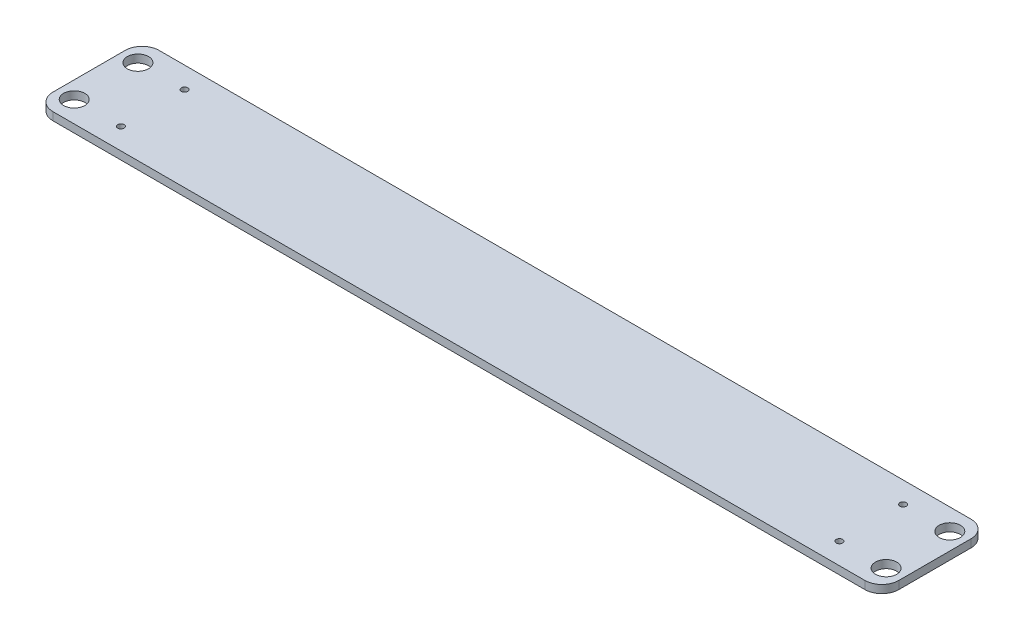
ISO-10303-21;
HEADER;
FILE_DESCRIPTION(('STEP AP214'),'2;1');
FILE_NAME('part.step','',(''),(''),'','','');
FILE_SCHEMA(('AUTOMOTIVE_DESIGN { 1 0 10303 214 1 1 1 1 }'));
ENDSEC;
DATA;
#1=APPLICATION_CONTEXT('core data for automotive mechanical design processes');
#2=APPLICATION_PROTOCOL_DEFINITION('international standard','automotive_design',2000,#1);
#3=PRODUCT_CONTEXT('',#1,'mechanical');
#4=PRODUCT('Part','Part','',(#3));
#5=PRODUCT_RELATED_PRODUCT_CATEGORY('part','',(#4));
#6=PRODUCT_DEFINITION_FORMATION('','',#4);
#7=PRODUCT_DEFINITION_CONTEXT('part definition',#1,'design');
#8=PRODUCT_DEFINITION('design','',#6,#7);
#9=PRODUCT_DEFINITION_SHAPE('','',#8);
#10=(LENGTH_UNIT() NAMED_UNIT(*) SI_UNIT(.MILLI.,.METRE.));
#11=(NAMED_UNIT(*) PLANE_ANGLE_UNIT() SI_UNIT($,.RADIAN.));
#12=(NAMED_UNIT(*) SI_UNIT($,.STERADIAN.) SOLID_ANGLE_UNIT());
#13=UNCERTAINTY_MEASURE_WITH_UNIT(LENGTH_MEASURE(1.E-05),#10,'distance_accuracy_value','');
#14=(GEOMETRIC_REPRESENTATION_CONTEXT(3) GLOBAL_UNCERTAINTY_ASSIGNED_CONTEXT((#13)) GLOBAL_UNIT_ASSIGNED_CONTEXT((#10,
#11,#12)) REPRESENTATION_CONTEXT('',''));
#15=CARTESIAN_POINT('',(0.,0.,0.));
#16=DIRECTION('',(0.,0.,1.));
#17=DIRECTION('',(1.,0.,0.));
#18=AXIS2_PLACEMENT_3D('',#15,#16,#17);
#19=CARTESIAN_POINT('',(10.16,4.7625,10.16));
#20=DIRECTION('',(0.,1.,0.));
#21=DIRECTION('',(0.,0.,1.));
#22=AXIS2_PLACEMENT_3D('',#19,#20,#21);
#23=PLANE('',#22);
#24=CARTESIAN_POINT('',(38.1,4.7625,50.8));
#25=DIRECTION('',(0.,1.,0.));
#26=DIRECTION('',(0.,0.,1.));
#27=AXIS2_PLACEMENT_3D('',#24,#25,#26);
#28=CIRCLE('',#27,1.905);
#29=CARTESIAN_POINT('',(38.1,4.7625,52.705));
#30=VERTEX_POINT('',#29);
#31=EDGE_CURVE('E150',#30,#30,#28,.T.);
#32=ORIENTED_EDGE('',*,*,#31,.F.);
#33=EDGE_LOOP('',(#32));
#34=FACE_BOUND('',#33,.T.);
#35=CARTESIAN_POINT('',(10.16,4.7625,50.8));
#36=DIRECTION('',(0.,1.,0.));
#37=DIRECTION('',(0.,0.,1.));
#38=AXIS2_PLACEMENT_3D('',#35,#36,#37);
#39=CIRCLE('',#38,6.35);
#40=CARTESIAN_POINT('',(10.16,4.7625,57.15));
#41=VERTEX_POINT('',#40);
#42=EDGE_CURVE('E162',#41,#41,#39,.T.);
#43=ORIENTED_EDGE('',*,*,#42,.F.);
#44=EDGE_LOOP('',(#43));
#45=FACE_BOUND('',#44,.T.);
#46=DIRECTION('',(0.,0.,1.));
#47=VECTOR('',#46,1.);
#48=CARTESIAN_POINT('',(0.,4.7625,43.815));
#49=LINE('',#48,#47);
#50=CARTESIAN_POINT('',(0.,4.7625,10.16));
#51=VERTEX_POINT('',#50);
#52=CARTESIAN_POINT('',(0.,4.7625,53.34));
#53=VERTEX_POINT('',#52);
#54=EDGE_CURVE('E50',#51,#53,#49,.T.);
#55=ORIENTED_EDGE('',*,*,#54,.T.);
#56=CARTESIAN_POINT('',(10.16,4.7625,53.34));
#57=DIRECTION('',(0.,1.,0.));
#58=DIRECTION('',(0.,0.,1.));
#59=AXIS2_PLACEMENT_3D('',#56,#57,#58);
#60=CIRCLE('',#59,10.16);
#61=CARTESIAN_POINT('',(10.16,4.7625,63.5));
#62=VERTEX_POINT('',#61);
#63=EDGE_CURVE('E169',#53,#62,#60,.T.);
#64=ORIENTED_EDGE('',*,*,#63,.T.);
#65=DIRECTION('',(1.,0.,0.));
#66=VECTOR('',#65,1.);
#67=CARTESIAN_POINT('',(10.16,4.7625,63.5));
#68=LINE('',#67,#66);
#69=CARTESIAN_POINT('',(495.935,4.7625,63.5));
#70=VERTEX_POINT('',#69);
#71=EDGE_CURVE('E172',#62,#70,#68,.T.);
#72=ORIENTED_EDGE('',*,*,#71,.T.);
#73=CARTESIAN_POINT('',(495.935,4.7625,53.34));
#74=DIRECTION('',(0.,-1.,0.));
#75=DIRECTION('',(0.,0.,1.));
#76=AXIS2_PLACEMENT_3D('',#73,#74,#75);
#77=CIRCLE('',#76,10.16);
#78=CARTESIAN_POINT('',(506.095,4.7625,53.34));
#79=VERTEX_POINT('',#78);
#80=EDGE_CURVE('E110',#79,#70,#77,.T.);
#81=ORIENTED_EDGE('',*,*,#80,.F.);
#82=DIRECTION('',(0.,0.,1.));
#83=VECTOR('',#82,1.);
#84=CARTESIAN_POINT('',(506.095,4.7625,43.815));
#85=LINE('',#84,#83);
#86=CARTESIAN_POINT('',(506.095,4.7625,10.16));
#87=VERTEX_POINT('',#86);
#88=EDGE_CURVE('E104',#87,#79,#85,.T.);
#89=ORIENTED_EDGE('',*,*,#88,.F.);
#90=CARTESIAN_POINT('',(495.935,4.7625,10.16));
#91=DIRECTION('',(0.,-1.,0.));
#92=DIRECTION('',(0.,0.,1.));
#93=AXIS2_PLACEMENT_3D('',#90,#91,#92);
#94=CIRCLE('',#93,10.16);
#95=CARTESIAN_POINT('',(495.935,4.7625,0.));
#96=VERTEX_POINT('',#95);
#97=EDGE_CURVE('E108',#96,#87,#94,.T.);
#98=ORIENTED_EDGE('',*,*,#97,.F.);
#99=DIRECTION('',(-1.,0.,0.));
#100=VECTOR('',#99,1.);
#101=CARTESIAN_POINT('',(10.16,4.7625,0.));
#102=LINE('',#101,#100);
#103=CARTESIAN_POINT('',(10.16,4.7625,0.));
#104=VERTEX_POINT('',#103);
#105=EDGE_CURVE('E174',#96,#104,#102,.T.);
#106=ORIENTED_EDGE('',*,*,#105,.T.);
#107=CARTESIAN_POINT('',(10.16,4.7625,10.16));
#108=DIRECTION('',(0.,1.,0.));
#109=DIRECTION('',(0.,0.,1.));
#110=AXIS2_PLACEMENT_3D('',#107,#108,#109);
#111=CIRCLE('',#110,10.16);
#112=EDGE_CURVE('E176',#104,#51,#111,.T.);
#113=ORIENTED_EDGE('',*,*,#112,.T.);
#114=EDGE_LOOP('',(#55,#64,#72,#81,#89,#98,#106,#113));
#115=FACE_BOUND('',#114,.T.);
#116=CARTESIAN_POINT('',(10.16,4.7625,12.7));
#117=DIRECTION('',(0.,1.,0.));
#118=DIRECTION('',(0.,0.,1.));
#119=AXIS2_PLACEMENT_3D('',#116,#117,#118);
#120=CIRCLE('',#119,6.35);
#121=CARTESIAN_POINT('',(10.16,4.7625,19.05));
#122=VERTEX_POINT('',#121);
#123=EDGE_CURVE('E156',#122,#122,#120,.T.);
#124=ORIENTED_EDGE('',*,*,#123,.F.);
#125=EDGE_LOOP('',(#124));
#126=FACE_BOUND('',#125,.T.);
#127=CARTESIAN_POINT('',(38.1,4.7625,12.7));
#128=DIRECTION('',(0.,1.,0.));
#129=DIRECTION('',(0.,0.,1.));
#130=AXIS2_PLACEMENT_3D('',#127,#128,#129);
#131=CIRCLE('',#130,1.905);
#132=CARTESIAN_POINT('',(38.1,4.7625,14.605));
#133=VERTEX_POINT('',#132);
#134=EDGE_CURVE('E144',#133,#133,#131,.T.);
#135=ORIENTED_EDGE('',*,*,#134,.F.);
#136=EDGE_LOOP('',(#135));
#137=FACE_BOUND('',#136,.T.);
#138=CARTESIAN_POINT('',(467.995,4.7625,12.7));
#139=DIRECTION('',(0.,-1.,0.));
#140=DIRECTION('',(0.,0.,1.));
#141=AXIS2_PLACEMENT_3D('',#138,#139,#140);
#142=CIRCLE('',#141,1.905);
#143=CARTESIAN_POINT('',(467.995,4.7625,14.605));
#144=VERTEX_POINT('',#143);
#145=EDGE_CURVE('E328',#144,#144,#142,.T.);
#146=ORIENTED_EDGE('',*,*,#145,.T.);
#147=EDGE_LOOP('',(#146));
#148=FACE_BOUND('',#147,.T.);
#149=CARTESIAN_POINT('',(467.995,4.7625,50.8));
#150=DIRECTION('',(0.,-1.,0.));
#151=DIRECTION('',(0.,0.,1.));
#152=AXIS2_PLACEMENT_3D('',#149,#150,#151);
#153=CIRCLE('',#152,1.905);
#154=CARTESIAN_POINT('',(467.995,4.7625,52.705));
#155=VERTEX_POINT('',#154);
#156=EDGE_CURVE('E337',#155,#155,#153,.T.);
#157=ORIENTED_EDGE('',*,*,#156,.T.);
#158=EDGE_LOOP('',(#157));
#159=FACE_BOUND('',#158,.T.);
#160=CARTESIAN_POINT('',(495.935,4.7625,12.7));
#161=DIRECTION('',(0.,-1.,0.));
#162=DIRECTION('',(0.,0.,1.));
#163=AXIS2_PLACEMENT_3D('',#160,#161,#162);
#164=CIRCLE('',#163,6.35);
#165=CARTESIAN_POINT('',(495.935,4.7625,19.05));
#166=VERTEX_POINT('',#165);
#167=EDGE_CURVE('E343',#166,#166,#164,.T.);
#168=ORIENTED_EDGE('',*,*,#167,.T.);
#169=EDGE_LOOP('',(#168));
#170=FACE_BOUND('',#169,.T.);
#171=CARTESIAN_POINT('',(495.935,4.7625,50.8));
#172=DIRECTION('',(0.,-1.,0.));
#173=DIRECTION('',(0.,0.,1.));
#174=AXIS2_PLACEMENT_3D('',#171,#172,#173);
#175=CIRCLE('',#174,6.35);
#176=CARTESIAN_POINT('',(495.935,4.7625,57.15));
#177=VERTEX_POINT('',#176);
#178=EDGE_CURVE('E135',#177,#177,#175,.T.);
#179=ORIENTED_EDGE('',*,*,#178,.T.);
#180=EDGE_LOOP('',(#179));
#181=FACE_BOUND('',#180,.T.);
#182=ADVANCED_FACE('F33',(#34,#45,#115,#126,#137,#148,#159,#170,#181),#23,.T.);
#183=CARTESIAN_POINT('',(10.16,0.,10.16));
#184=DIRECTION('',(0.,1.,0.));
#185=DIRECTION('',(0.,0.,1.));
#186=AXIS2_PLACEMENT_3D('',#183,#184,#185);
#187=PLANE('',#186);
#188=CARTESIAN_POINT('',(10.16,0.,53.34));
#189=DIRECTION('',(0.,1.,0.));
#190=DIRECTION('',(0.,0.,1.));
#191=AXIS2_PLACEMENT_3D('',#188,#189,#190);
#192=CIRCLE('',#191,10.16);
#193=CARTESIAN_POINT('',(0.,0.,53.34));
#194=VERTEX_POINT('',#193);
#195=CARTESIAN_POINT('',(10.16,0.,63.5));
#196=VERTEX_POINT('',#195);
#197=EDGE_CURVE('E165',#194,#196,#192,.T.);
#198=ORIENTED_EDGE('',*,*,#197,.F.);
#199=DIRECTION('',(0.,0.,1.));
#200=VECTOR('',#199,1.);
#201=CARTESIAN_POINT('',(0.,0.,10.16));
#202=LINE('',#201,#200);
#203=CARTESIAN_POINT('',(0.,0.,10.16));
#204=VERTEX_POINT('',#203);
#205=EDGE_CURVE('E170',#204,#194,#202,.T.);
#206=ORIENTED_EDGE('',*,*,#205,.F.);
#207=CARTESIAN_POINT('',(10.16,0.,10.16));
#208=DIRECTION('',(0.,1.,0.));
#209=DIRECTION('',(0.,0.,1.));
#210=AXIS2_PLACEMENT_3D('',#207,#208,#209);
#211=CIRCLE('',#210,10.16);
#212=CARTESIAN_POINT('',(10.16,0.,0.));
#213=VERTEX_POINT('',#212);
#214=EDGE_CURVE('E76',#213,#204,#211,.T.);
#215=ORIENTED_EDGE('',*,*,#214,.F.);
#216=DIRECTION('',(-1.,0.,0.));
#217=VECTOR('',#216,1.);
#218=CARTESIAN_POINT('',(10.16,0.,0.));
#219=LINE('',#218,#217);
#220=CARTESIAN_POINT('',(495.935,0.,0.));
#221=VERTEX_POINT('',#220);
#222=EDGE_CURVE('E69',#221,#213,#219,.T.);
#223=ORIENTED_EDGE('',*,*,#222,.F.);
#224=CARTESIAN_POINT('',(495.935,0.,10.16));
#225=DIRECTION('',(0.,-1.,0.));
#226=DIRECTION('',(0.,0.,1.));
#227=AXIS2_PLACEMENT_3D('',#224,#225,#226);
#228=CIRCLE('',#227,10.16);
#229=CARTESIAN_POINT('',(506.095,0.,10.16));
#230=VERTEX_POINT('',#229);
#231=EDGE_CURVE('E132',#221,#230,#228,.T.);
#232=ORIENTED_EDGE('',*,*,#231,.T.);
#233=DIRECTION('',(0.,0.,1.));
#234=VECTOR('',#233,1.);
#235=CARTESIAN_POINT('',(506.095,0.,43.815));
#236=LINE('',#235,#234);
#237=CARTESIAN_POINT('',(506.095,0.,53.34));
#238=VERTEX_POINT('',#237);
#239=EDGE_CURVE('E113',#230,#238,#236,.T.);
#240=ORIENTED_EDGE('',*,*,#239,.T.);
#241=CARTESIAN_POINT('',(495.935,0.,53.34));
#242=DIRECTION('',(0.,-1.,0.));
#243=DIRECTION('',(0.,0.,1.));
#244=AXIS2_PLACEMENT_3D('',#241,#242,#243);
#245=CIRCLE('',#244,10.16);
#246=CARTESIAN_POINT('',(495.935,0.,63.5));
#247=VERTEX_POINT('',#246);
#248=EDGE_CURVE('E134',#238,#247,#245,.T.);
#249=ORIENTED_EDGE('',*,*,#248,.T.);
#250=DIRECTION('',(1.,0.,0.));
#251=VECTOR('',#250,1.);
#252=CARTESIAN_POINT('',(10.16,0.,63.5));
#253=LINE('',#252,#251);
#254=EDGE_CURVE('E180',#196,#247,#253,.T.);
#255=ORIENTED_EDGE('',*,*,#254,.F.);
#256=EDGE_LOOP('',(#198,#206,#215,#223,#232,#240,#249,#255));
#257=FACE_BOUND('',#256,.T.);
#258=CARTESIAN_POINT('',(10.16,0.,50.8));
#259=DIRECTION('',(0.,1.,0.));
#260=DIRECTION('',(0.,0.,1.));
#261=AXIS2_PLACEMENT_3D('',#258,#259,#260);
#262=CIRCLE('',#261,6.35);
#263=CARTESIAN_POINT('',(10.16,0.,57.15));
#264=VERTEX_POINT('',#263);
#265=EDGE_CURVE('E159',#264,#264,#262,.T.);
#266=ORIENTED_EDGE('',*,*,#265,.T.);
#267=EDGE_LOOP('',(#266));
#268=FACE_BOUND('',#267,.T.);
#269=CARTESIAN_POINT('',(10.16,0.,12.7));
#270=DIRECTION('',(0.,1.,0.));
#271=DIRECTION('',(0.,0.,1.));
#272=AXIS2_PLACEMENT_3D('',#269,#270,#271);
#273=CIRCLE('',#272,6.35);
#274=CARTESIAN_POINT('',(10.16,0.,19.05));
#275=VERTEX_POINT('',#274);
#276=EDGE_CURVE('E153',#275,#275,#273,.T.);
#277=ORIENTED_EDGE('',*,*,#276,.T.);
#278=EDGE_LOOP('',(#277));
#279=FACE_BOUND('',#278,.T.);
#280=CARTESIAN_POINT('',(38.1,0.,50.8));
#281=DIRECTION('',(0.,1.,0.));
#282=DIRECTION('',(0.,0.,1.));
#283=AXIS2_PLACEMENT_3D('',#280,#281,#282);
#284=CIRCLE('',#283,1.905);
#285=CARTESIAN_POINT('',(38.1,0.,52.705));
#286=VERTEX_POINT('',#285);
#287=EDGE_CURVE('E147',#286,#286,#284,.T.);
#288=ORIENTED_EDGE('',*,*,#287,.T.);
#289=EDGE_LOOP('',(#288));
#290=FACE_BOUND('',#289,.T.);
#291=CARTESIAN_POINT('',(38.1,0.,12.7));
#292=DIRECTION('',(0.,1.,0.));
#293=DIRECTION('',(0.,0.,1.));
#294=AXIS2_PLACEMENT_3D('',#291,#292,#293);
#295=CIRCLE('',#294,1.905);
#296=CARTESIAN_POINT('',(38.1,0.,14.605));
#297=VERTEX_POINT('',#296);
#298=EDGE_CURVE('E122',#297,#297,#295,.T.);
#299=ORIENTED_EDGE('',*,*,#298,.T.);
#300=EDGE_LOOP('',(#299));
#301=FACE_BOUND('',#300,.T.);
#302=CARTESIAN_POINT('',(467.995,0.,12.7));
#303=DIRECTION('',(0.,-1.,0.));
#304=DIRECTION('',(0.,0.,1.));
#305=AXIS2_PLACEMENT_3D('',#302,#303,#304);
#306=CIRCLE('',#305,1.905);
#307=CARTESIAN_POINT('',(467.995,0.,14.605));
#308=VERTEX_POINT('',#307);
#309=EDGE_CURVE('E331',#308,#308,#306,.T.);
#310=ORIENTED_EDGE('',*,*,#309,.F.);
#311=EDGE_LOOP('',(#310));
#312=FACE_BOUND('',#311,.T.);
#313=CARTESIAN_POINT('',(467.995,0.,50.8));
#314=DIRECTION('',(0.,-1.,0.));
#315=DIRECTION('',(0.,0.,1.));
#316=AXIS2_PLACEMENT_3D('',#313,#314,#315);
#317=CIRCLE('',#316,1.905);
#318=CARTESIAN_POINT('',(467.995,0.,52.705));
#319=VERTEX_POINT('',#318);
#320=EDGE_CURVE('E334',#319,#319,#317,.T.);
#321=ORIENTED_EDGE('',*,*,#320,.F.);
#322=EDGE_LOOP('',(#321));
#323=FACE_BOUND('',#322,.T.);
#324=CARTESIAN_POINT('',(495.935,0.,12.7));
#325=DIRECTION('',(0.,-1.,0.));
#326=DIRECTION('',(0.,0.,1.));
#327=AXIS2_PLACEMENT_3D('',#324,#325,#326);
#328=CIRCLE('',#327,6.35);
#329=CARTESIAN_POINT('',(495.935,0.,19.05));
#330=VERTEX_POINT('',#329);
#331=EDGE_CURVE('E340',#330,#330,#328,.T.);
#332=ORIENTED_EDGE('',*,*,#331,.F.);
#333=EDGE_LOOP('',(#332));
#334=FACE_BOUND('',#333,.T.);
#335=CARTESIAN_POINT('',(495.935,0.,50.8));
#336=DIRECTION('',(0.,-1.,0.));
#337=DIRECTION('',(0.,0.,1.));
#338=AXIS2_PLACEMENT_3D('',#335,#336,#337);
#339=CIRCLE('',#338,6.35);
#340=CARTESIAN_POINT('',(495.935,0.,57.15));
#341=VERTEX_POINT('',#340);
#342=EDGE_CURVE('E346',#341,#341,#339,.T.);
#343=ORIENTED_EDGE('',*,*,#342,.F.);
#344=EDGE_LOOP('',(#343));
#345=FACE_BOUND('',#344,.T.);
#346=ADVANCED_FACE('F198',(#257,#268,#279,#290,#301,#312,#323,#334,#345),#187,.F.);
#347=CARTESIAN_POINT('',(10.16,4.7625,53.34));
#348=DIRECTION('',(0.,-1.,0.));
#349=DIRECTION('',(0.,0.,-1.));
#350=AXIS2_PLACEMENT_3D('',#347,#348,#349);
#351=CYLINDRICAL_SURFACE('',#350,10.16);
#352=ORIENTED_EDGE('',*,*,#197,.T.);
#353=DIRECTION('',(0.,-1.,0.));
#354=VECTOR('',#353,1.);
#355=CARTESIAN_POINT('',(10.16,4.7625,63.5));
#356=LINE('',#355,#354);
#357=EDGE_CURVE('E42',#62,#196,#356,.T.);
#358=ORIENTED_EDGE('',*,*,#357,.F.);
#359=ORIENTED_EDGE('',*,*,#63,.F.);
#360=DIRECTION('',(0.,-1.,0.));
#361=VECTOR('',#360,1.);
#362=CARTESIAN_POINT('',(0.,4.7625,53.34));
#363=LINE('',#362,#361);
#364=EDGE_CURVE('E11',#53,#194,#363,.T.);
#365=ORIENTED_EDGE('',*,*,#364,.T.);
#366=EDGE_LOOP('',(#352,#358,#359,#365));
#367=FACE_BOUND('',#366,.T.);
#368=ADVANCED_FACE('F35',(#367),#351,.T.);
#369=CARTESIAN_POINT('',(10.16,4.7625,63.5));
#370=DIRECTION('',(0.,0.,-1.));
#371=DIRECTION('',(-1.,0.,0.));
#372=AXIS2_PLACEMENT_3D('',#369,#370,#371);
#373=PLANE('',#372);
#374=ORIENTED_EDGE('',*,*,#254,.T.);
#375=DIRECTION('',(0.,-1.,0.));
#376=VECTOR('',#375,1.);
#377=CARTESIAN_POINT('',(495.935,4.7625,63.5));
#378=LINE('',#377,#376);
#379=EDGE_CURVE('E140',#70,#247,#378,.T.);
#380=ORIENTED_EDGE('',*,*,#379,.F.);
#381=ORIENTED_EDGE('',*,*,#71,.F.);
#382=ORIENTED_EDGE('',*,*,#357,.T.);
#383=EDGE_LOOP('',(#374,#380,#381,#382));
#384=FACE_BOUND('',#383,.T.);
#385=ADVANCED_FACE('F192',(#384),#373,.F.);
#386=CARTESIAN_POINT('',(10.16,4.7625,0.));
#387=DIRECTION('',(0.,0.,1.));
#388=DIRECTION('',(1.,0.,0.));
#389=AXIS2_PLACEMENT_3D('',#386,#387,#388);
#390=PLANE('',#389);
#391=ORIENTED_EDGE('',*,*,#222,.T.);
#392=DIRECTION('',(0.,-1.,0.));
#393=VECTOR('',#392,1.);
#394=CARTESIAN_POINT('',(10.16,4.7625,0.));
#395=LINE('',#394,#393);
#396=EDGE_CURVE('E186',#104,#213,#395,.T.);
#397=ORIENTED_EDGE('',*,*,#396,.F.);
#398=ORIENTED_EDGE('',*,*,#105,.F.);
#399=DIRECTION('',(0.,-1.,0.));
#400=VECTOR('',#399,1.);
#401=CARTESIAN_POINT('',(495.935,4.7625,0.));
#402=LINE('',#401,#400);
#403=EDGE_CURVE('E123',#96,#221,#402,.T.);
#404=ORIENTED_EDGE('',*,*,#403,.T.);
#405=EDGE_LOOP('',(#391,#397,#398,#404));
#406=FACE_BOUND('',#405,.T.);
#407=ADVANCED_FACE('F233',(#406),#390,.F.);
#408=CARTESIAN_POINT('',(10.16,4.7625,10.16));
#409=DIRECTION('',(0.,-1.,0.));
#410=DIRECTION('',(0.,0.,-1.));
#411=AXIS2_PLACEMENT_3D('',#408,#409,#410);
#412=CYLINDRICAL_SURFACE('',#411,10.16);
#413=ORIENTED_EDGE('',*,*,#214,.T.);
#414=DIRECTION('',(0.,-1.,0.));
#415=VECTOR('',#414,1.);
#416=CARTESIAN_POINT('',(0.,4.7625,10.16));
#417=LINE('',#416,#415);
#418=EDGE_CURVE('E178',#51,#204,#417,.T.);
#419=ORIENTED_EDGE('',*,*,#418,.F.);
#420=ORIENTED_EDGE('',*,*,#112,.F.);
#421=ORIENTED_EDGE('',*,*,#396,.T.);
#422=EDGE_LOOP('',(#413,#419,#420,#421));
#423=FACE_BOUND('',#422,.T.);
#424=ADVANCED_FACE('F230',(#423),#412,.T.);
#425=CARTESIAN_POINT('',(0.,4.7625,10.16));
#426=DIRECTION('',(1.,0.,0.));
#427=DIRECTION('',(0.,0.,-1.));
#428=AXIS2_PLACEMENT_3D('',#425,#426,#427);
#429=PLANE('',#428);
#430=ORIENTED_EDGE('',*,*,#205,.T.);
#431=ORIENTED_EDGE('',*,*,#364,.F.);
#432=ORIENTED_EDGE('',*,*,#54,.F.);
#433=ORIENTED_EDGE('',*,*,#418,.T.);
#434=EDGE_LOOP('',(#430,#431,#432,#433));
#435=FACE_BOUND('',#434,.T.);
#436=ADVANCED_FACE('F227',(#435),#429,.F.);
#437=CARTESIAN_POINT('',(10.16,4.7625,50.8));
#438=DIRECTION('',(0.,-1.,0.));
#439=DIRECTION('',(0.,0.,-1.));
#440=AXIS2_PLACEMENT_3D('',#437,#438,#439);
#441=CYLINDRICAL_SURFACE('',#440,6.35);
#442=ORIENTED_EDGE('',*,*,#42,.T.);
#443=EDGE_LOOP('',(#442));
#444=FACE_BOUND('',#443,.T.);
#445=ORIENTED_EDGE('',*,*,#265,.F.);
#446=EDGE_LOOP('',(#445));
#447=FACE_BOUND('',#446,.T.);
#448=ADVANCED_FACE('F224',(#444,#447),#441,.F.);
#449=CARTESIAN_POINT('',(10.16,4.7625,12.7));
#450=DIRECTION('',(0.,-1.,0.));
#451=DIRECTION('',(0.,0.,-1.));
#452=AXIS2_PLACEMENT_3D('',#449,#450,#451);
#453=CYLINDRICAL_SURFACE('',#452,6.35);
#454=ORIENTED_EDGE('',*,*,#123,.T.);
#455=EDGE_LOOP('',(#454));
#456=FACE_BOUND('',#455,.T.);
#457=ORIENTED_EDGE('',*,*,#276,.F.);
#458=EDGE_LOOP('',(#457));
#459=FACE_BOUND('',#458,.T.);
#460=ADVANCED_FACE('F381',(#456,#459),#453,.F.);
#461=CARTESIAN_POINT('',(38.1,4.7625,50.8));
#462=DIRECTION('',(0.,-1.,0.));
#463=DIRECTION('',(0.,0.,-1.));
#464=AXIS2_PLACEMENT_3D('',#461,#462,#463);
#465=CYLINDRICAL_SURFACE('',#464,1.905);
#466=ORIENTED_EDGE('',*,*,#31,.T.);
#467=EDGE_LOOP('',(#466));
#468=FACE_BOUND('',#467,.T.);
#469=ORIENTED_EDGE('',*,*,#287,.F.);
#470=EDGE_LOOP('',(#469));
#471=FACE_BOUND('',#470,.T.);
#472=ADVANCED_FACE('F373',(#468,#471),#465,.F.);
#473=CARTESIAN_POINT('',(38.1,4.7625,12.7));
#474=DIRECTION('',(0.,-1.,0.));
#475=DIRECTION('',(0.,0.,-1.));
#476=AXIS2_PLACEMENT_3D('',#473,#474,#475);
#477=CYLINDRICAL_SURFACE('',#476,1.905);
#478=ORIENTED_EDGE('',*,*,#134,.T.);
#479=EDGE_LOOP('',(#478));
#480=FACE_BOUND('',#479,.T.);
#481=ORIENTED_EDGE('',*,*,#298,.F.);
#482=EDGE_LOOP('',(#481));
#483=FACE_BOUND('',#482,.T.);
#484=ADVANCED_FACE('F212',(#480,#483),#477,.F.);
#485=CARTESIAN_POINT('',(495.935,4.7625,10.16));
#486=DIRECTION('',(0.,-1.,0.));
#487=DIRECTION('',(0.,0.,-1.));
#488=AXIS2_PLACEMENT_3D('',#485,#486,#487);
#489=CYLINDRICAL_SURFACE('',#488,10.16);
#490=ORIENTED_EDGE('',*,*,#231,.F.);
#491=ORIENTED_EDGE('',*,*,#403,.F.);
#492=ORIENTED_EDGE('',*,*,#97,.T.);
#493=DIRECTION('',(0.,-1.,0.));
#494=VECTOR('',#493,1.);
#495=CARTESIAN_POINT('',(506.095,4.7625,10.16));
#496=LINE('',#495,#494);
#497=EDGE_CURVE('E116',#87,#230,#496,.T.);
#498=ORIENTED_EDGE('',*,*,#497,.T.);
#499=EDGE_LOOP('',(#490,#491,#492,#498));
#500=FACE_BOUND('',#499,.T.);
#501=ADVANCED_FACE('F126',(#500),#489,.T.);
#502=CARTESIAN_POINT('',(495.935,4.7625,53.34));
#503=DIRECTION('',(0.,-1.,0.));
#504=DIRECTION('',(0.,0.,-1.));
#505=AXIS2_PLACEMENT_3D('',#502,#503,#504);
#506=CYLINDRICAL_SURFACE('',#505,10.16);
#507=ORIENTED_EDGE('',*,*,#248,.F.);
#508=DIRECTION('',(0.,-1.,0.));
#509=VECTOR('',#508,1.);
#510=CARTESIAN_POINT('',(506.095,4.7625,53.34));
#511=LINE('',#510,#509);
#512=EDGE_CURVE('E128',#79,#238,#511,.T.);
#513=ORIENTED_EDGE('',*,*,#512,.F.);
#514=ORIENTED_EDGE('',*,*,#80,.T.);
#515=ORIENTED_EDGE('',*,*,#379,.T.);
#516=EDGE_LOOP('',(#507,#513,#514,#515));
#517=FACE_BOUND('',#516,.T.);
#518=ADVANCED_FACE('F203',(#517),#506,.T.);
#519=CARTESIAN_POINT('',(506.095,4.7625,43.815));
#520=DIRECTION('',(1.,0.,0.));
#521=DIRECTION('',(0.,0.,-1.));
#522=AXIS2_PLACEMENT_3D('',#519,#520,#521);
#523=PLANE('',#522);
#524=ORIENTED_EDGE('',*,*,#239,.F.);
#525=ORIENTED_EDGE('',*,*,#497,.F.);
#526=ORIENTED_EDGE('',*,*,#88,.T.);
#527=ORIENTED_EDGE('',*,*,#512,.T.);
#528=EDGE_LOOP('',(#524,#525,#526,#527));
#529=FACE_BOUND('',#528,.T.);
#530=ADVANCED_FACE('F117',(#529),#523,.T.);
#531=CARTESIAN_POINT('',(495.935,4.7625,50.8));
#532=DIRECTION('',(0.,-1.,0.));
#533=DIRECTION('',(0.,0.,-1.));
#534=AXIS2_PLACEMENT_3D('',#531,#532,#533);
#535=CYLINDRICAL_SURFACE('',#534,6.35);
#536=ORIENTED_EDGE('',*,*,#178,.F.);
#537=EDGE_LOOP('',(#536));
#538=FACE_BOUND('',#537,.T.);
#539=ORIENTED_EDGE('',*,*,#342,.T.);
#540=EDGE_LOOP('',(#539));
#541=FACE_BOUND('',#540,.T.);
#542=ADVANCED_FACE('F210',(#538,#541),#535,.F.);
#543=CARTESIAN_POINT('',(495.935,4.7625,12.7));
#544=DIRECTION('',(0.,-1.,0.));
#545=DIRECTION('',(0.,0.,-1.));
#546=AXIS2_PLACEMENT_3D('',#543,#544,#545);
#547=CYLINDRICAL_SURFACE('',#546,6.35);
#548=ORIENTED_EDGE('',*,*,#167,.F.);
#549=EDGE_LOOP('',(#548));
#550=FACE_BOUND('',#549,.T.);
#551=ORIENTED_EDGE('',*,*,#331,.T.);
#552=EDGE_LOOP('',(#551));
#553=FACE_BOUND('',#552,.T.);
#554=ADVANCED_FACE('F291',(#550,#553),#547,.F.);
#555=CARTESIAN_POINT('',(467.995,4.7625,50.8));
#556=DIRECTION('',(0.,-1.,0.));
#557=DIRECTION('',(0.,0.,-1.));
#558=AXIS2_PLACEMENT_3D('',#555,#556,#557);
#559=CYLINDRICAL_SURFACE('',#558,1.905);
#560=ORIENTED_EDGE('',*,*,#156,.F.);
#561=EDGE_LOOP('',(#560));
#562=FACE_BOUND('',#561,.T.);
#563=ORIENTED_EDGE('',*,*,#320,.T.);
#564=EDGE_LOOP('',(#563));
#565=FACE_BOUND('',#564,.T.);
#566=ADVANCED_FACE('F301',(#562,#565),#559,.F.);
#567=CARTESIAN_POINT('',(467.995,4.7625,12.7));
#568=DIRECTION('',(0.,-1.,0.));
#569=DIRECTION('',(0.,0.,-1.));
#570=AXIS2_PLACEMENT_3D('',#567,#568,#569);
#571=CYLINDRICAL_SURFACE('',#570,1.905);
#572=ORIENTED_EDGE('',*,*,#145,.F.);
#573=EDGE_LOOP('',(#572));
#574=FACE_BOUND('',#573,.T.);
#575=ORIENTED_EDGE('',*,*,#309,.T.);
#576=EDGE_LOOP('',(#575));
#577=FACE_BOUND('',#576,.T.);
#578=ADVANCED_FACE('F311',(#574,#577),#571,.F.);
#579=CLOSED_SHELL('',(#182,#346,#368,#385,#407,#424,#436,#448,#460,#472,#484,#501,#518,#530,
#542,#554,#566,#578));
#580=MANIFOLD_SOLID_BREP('B2',#579);
#581=ADVANCED_BREP_SHAPE_REPRESENTATION('',(#18,#580),#14);
#582=SHAPE_DEFINITION_REPRESENTATION(#9,#581);
ENDSEC;
END-ISO-10303-21;
